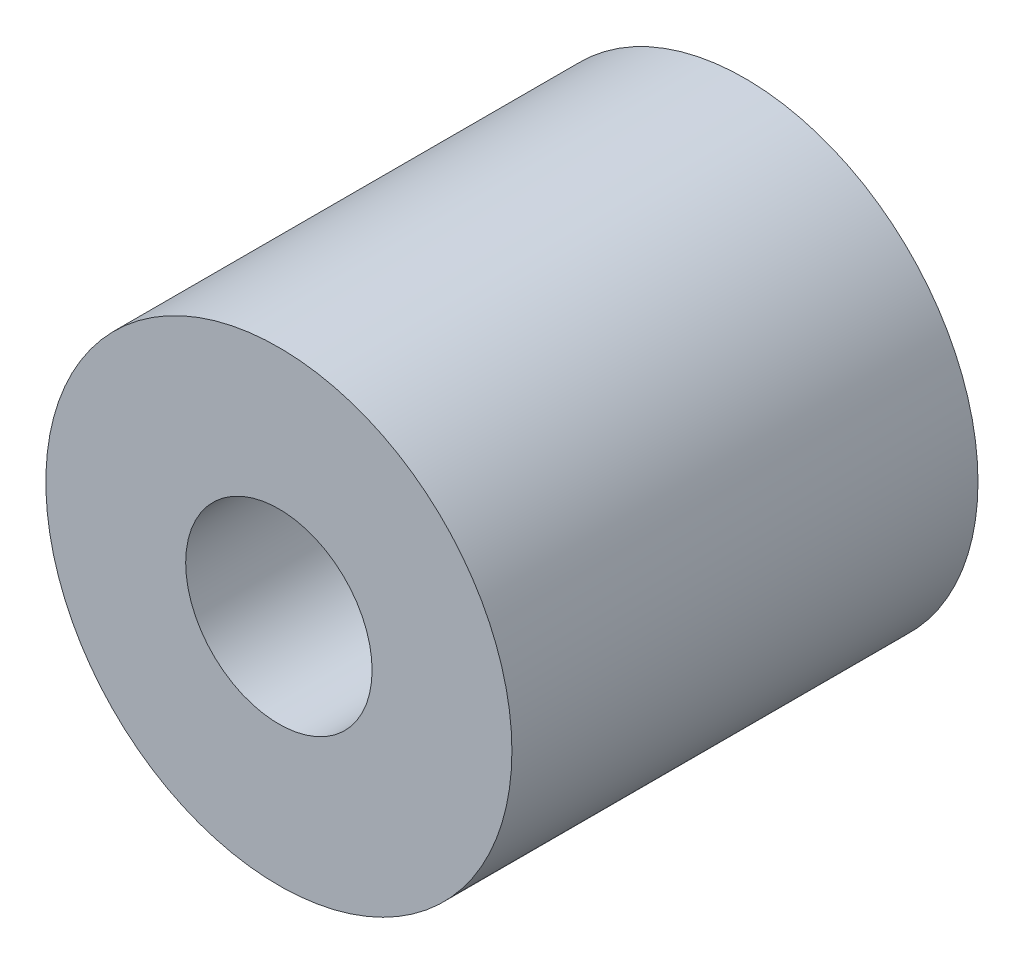
ISO-10303-21;
HEADER;
FILE_DESCRIPTION(('STEP AP214'),'2;1');
FILE_NAME('part.step','',(''),(''),'','','');
FILE_SCHEMA(('AUTOMOTIVE_DESIGN { 1 0 10303 214 1 1 1 1 }'));
ENDSEC;
DATA;
#1=APPLICATION_CONTEXT('core data for automotive mechanical design processes');
#2=APPLICATION_PROTOCOL_DEFINITION('international standard','automotive_design',2000,#1);
#3=PRODUCT_CONTEXT('',#1,'mechanical');
#4=PRODUCT('Part','Part','',(#3));
#5=PRODUCT_RELATED_PRODUCT_CATEGORY('part','',(#4));
#6=PRODUCT_DEFINITION_FORMATION('','',#4);
#7=PRODUCT_DEFINITION_CONTEXT('part definition',#1,'design');
#8=PRODUCT_DEFINITION('design','',#6,#7);
#9=PRODUCT_DEFINITION_SHAPE('','',#8);
#10=(LENGTH_UNIT() NAMED_UNIT(*) SI_UNIT(.MILLI.,.METRE.));
#11=(NAMED_UNIT(*) PLANE_ANGLE_UNIT() SI_UNIT($,.RADIAN.));
#12=(NAMED_UNIT(*) SI_UNIT($,.STERADIAN.) SOLID_ANGLE_UNIT());
#13=UNCERTAINTY_MEASURE_WITH_UNIT(LENGTH_MEASURE(1.E-05),#10,'distance_accuracy_value','');
#14=(GEOMETRIC_REPRESENTATION_CONTEXT(3) GLOBAL_UNCERTAINTY_ASSIGNED_CONTEXT((#13)) GLOBAL_UNIT_ASSIGNED_CONTEXT((#10,
#11,#12)) REPRESENTATION_CONTEXT('',''));
#15=CARTESIAN_POINT('',(0.,0.,0.));
#16=DIRECTION('',(0.,0.,1.));
#17=DIRECTION('',(1.,0.,0.));
#18=AXIS2_PLACEMENT_3D('',#15,#16,#17);
#19=CARTESIAN_POINT('',(0.,0.,10.));
#20=DIRECTION('',(0.,0.,1.));
#21=DIRECTION('',(1.,0.,0.));
#22=AXIS2_PLACEMENT_3D('',#19,#20,#21);
#23=PLANE('',#22);
#24=CARTESIAN_POINT('',(0.,0.,10.));
#25=DIRECTION('',(0.,0.,1.));
#26=DIRECTION('',(1.,0.,0.));
#27=AXIS2_PLACEMENT_3D('',#24,#25,#26);
#28=CIRCLE('',#27,5.);
#29=CARTESIAN_POINT('',(5.,0.,10.));
#30=VERTEX_POINT('',#29);
#31=EDGE_CURVE('E10',#30,#30,#28,.T.);
#32=ORIENTED_EDGE('',*,*,#31,.T.);
#33=EDGE_LOOP('',(#32));
#34=FACE_BOUND('',#33,.T.);
#35=CARTESIAN_POINT('',(0.,0.,10.));
#36=DIRECTION('',(0.,0.,1.));
#37=DIRECTION('',(1.,0.,0.));
#38=AXIS2_PLACEMENT_3D('',#35,#36,#37);
#39=CIRCLE('',#38,2.);
#40=CARTESIAN_POINT('',(2.,0.,10.));
#41=VERTEX_POINT('',#40);
#42=EDGE_CURVE('E41',#41,#41,#39,.T.);
#43=ORIENTED_EDGE('',*,*,#42,.F.);
#44=EDGE_LOOP('',(#43));
#45=FACE_BOUND('',#44,.T.);
#46=ADVANCED_FACE('F30',(#34,#45),#23,.T.);
#47=CARTESIAN_POINT('',(0.,0.,0.));
#48=DIRECTION('',(0.,0.,1.));
#49=DIRECTION('',(1.,0.,0.));
#50=AXIS2_PLACEMENT_3D('',#47,#48,#49);
#51=PLANE('',#50);
#52=CARTESIAN_POINT('',(0.,0.,0.));
#53=DIRECTION('',(0.,0.,1.));
#54=DIRECTION('',(1.,0.,0.));
#55=AXIS2_PLACEMENT_3D('',#52,#53,#54);
#56=CIRCLE('',#55,5.);
#57=CARTESIAN_POINT('',(5.,0.,0.));
#58=VERTEX_POINT('',#57);
#59=EDGE_CURVE('E34',#58,#58,#56,.T.);
#60=ORIENTED_EDGE('',*,*,#59,.F.);
#61=EDGE_LOOP('',(#60));
#62=FACE_BOUND('',#61,.T.);
#63=CARTESIAN_POINT('',(0.,0.,0.));
#64=DIRECTION('',(0.,0.,1.));
#65=DIRECTION('',(1.,0.,0.));
#66=AXIS2_PLACEMENT_3D('',#63,#64,#65);
#67=CIRCLE('',#66,2.);
#68=CARTESIAN_POINT('',(2.,0.,0.));
#69=VERTEX_POINT('',#68);
#70=EDGE_CURVE('E43',#69,#69,#67,.T.);
#71=ORIENTED_EDGE('',*,*,#70,.T.);
#72=EDGE_LOOP('',(#71));
#73=FACE_BOUND('',#72,.T.);
#74=ADVANCED_FACE('F53',(#62,#73),#51,.F.);
#75=CARTESIAN_POINT('',(0.,0.,10.));
#76=DIRECTION('',(0.,0.,-1.));
#77=DIRECTION('',(-1.,0.,0.));
#78=AXIS2_PLACEMENT_3D('',#75,#76,#77);
#79=CYLINDRICAL_SURFACE('',#78,5.);
#80=ORIENTED_EDGE('',*,*,#31,.F.);
#81=EDGE_LOOP('',(#80));
#82=FACE_BOUND('',#81,.T.);
#83=ORIENTED_EDGE('',*,*,#59,.T.);
#84=EDGE_LOOP('',(#83));
#85=FACE_BOUND('',#84,.T.);
#86=ADVANCED_FACE('F32',(#82,#85),#79,.T.);
#87=CARTESIAN_POINT('',(0.,0.,10.));
#88=DIRECTION('',(0.,0.,-1.));
#89=DIRECTION('',(-1.,0.,0.));
#90=AXIS2_PLACEMENT_3D('',#87,#88,#89);
#91=CYLINDRICAL_SURFACE('',#90,2.);
#92=ORIENTED_EDGE('',*,*,#42,.T.);
#93=EDGE_LOOP('',(#92));
#94=FACE_BOUND('',#93,.T.);
#95=ORIENTED_EDGE('',*,*,#70,.F.);
#96=EDGE_LOOP('',(#95));
#97=FACE_BOUND('',#96,.T.);
#98=ADVANCED_FACE('F49',(#94,#97),#91,.F.);
#99=CLOSED_SHELL('',(#46,#74,#86,#98));
#100=MANIFOLD_SOLID_BREP('B2',#99);
#101=ADVANCED_BREP_SHAPE_REPRESENTATION('',(#18,#100),#14);
#102=SHAPE_DEFINITION_REPRESENTATION(#9,#101);
ENDSEC;
END-ISO-10303-21;
